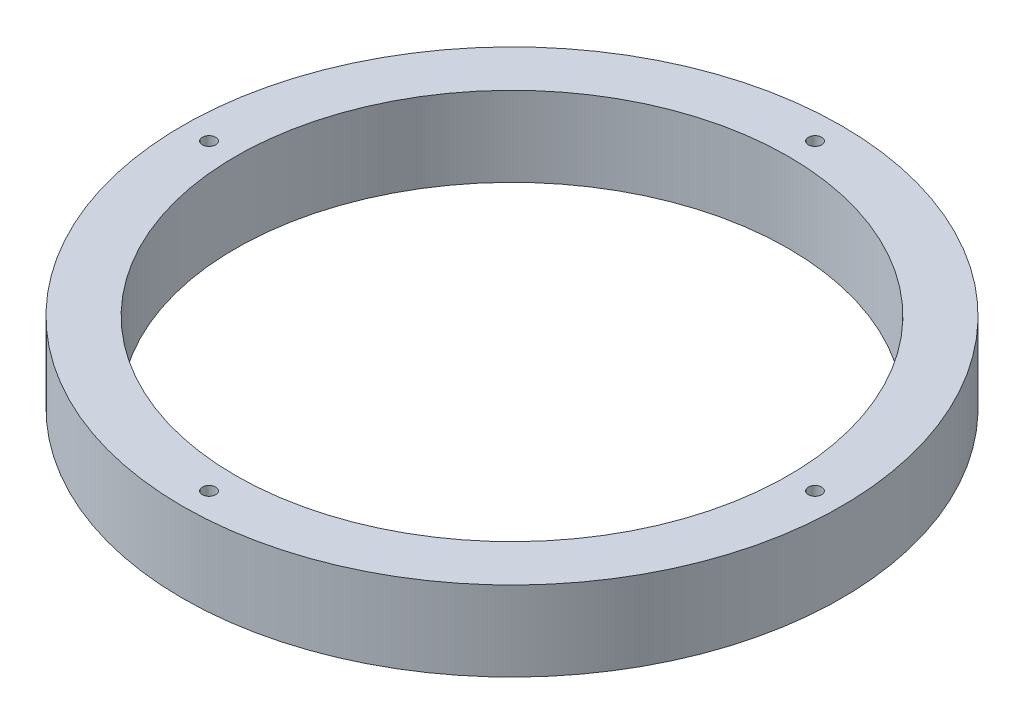
ISO-10303-21;
HEADER;
FILE_DESCRIPTION(('STEP AP214'),'2;1');
FILE_NAME('part.step','',(''),(''),'','','');
FILE_SCHEMA(('AUTOMOTIVE_DESIGN { 1 0 10303 214 1 1 1 1 }'));
ENDSEC;
DATA;
#1=APPLICATION_CONTEXT('core data for automotive mechanical design processes');
#2=APPLICATION_PROTOCOL_DEFINITION('international standard','automotive_design',2000,#1);
#3=PRODUCT_CONTEXT('',#1,'mechanical');
#4=PRODUCT('Part','Part','',(#3));
#5=PRODUCT_RELATED_PRODUCT_CATEGORY('part','',(#4));
#6=PRODUCT_DEFINITION_FORMATION('','',#4);
#7=PRODUCT_DEFINITION_CONTEXT('part definition',#1,'design');
#8=PRODUCT_DEFINITION('design','',#6,#7);
#9=PRODUCT_DEFINITION_SHAPE('','',#8);
#10=(LENGTH_UNIT() NAMED_UNIT(*) SI_UNIT(.MILLI.,.METRE.));
#11=(NAMED_UNIT(*) PLANE_ANGLE_UNIT() SI_UNIT($,.RADIAN.));
#12=(NAMED_UNIT(*) SI_UNIT($,.STERADIAN.) SOLID_ANGLE_UNIT());
#13=UNCERTAINTY_MEASURE_WITH_UNIT(LENGTH_MEASURE(1.E-05),#10,'distance_accuracy_value','');
#14=(GEOMETRIC_REPRESENTATION_CONTEXT(3) GLOBAL_UNCERTAINTY_ASSIGNED_CONTEXT((#13)) GLOBAL_UNIT_ASSIGNED_CONTEXT((#10,
#11,#12)) REPRESENTATION_CONTEXT('',''));
#15=CARTESIAN_POINT('',(0.,0.,0.));
#16=DIRECTION('',(0.,0.,1.));
#17=DIRECTION('',(1.,0.,0.));
#18=AXIS2_PLACEMENT_3D('',#15,#16,#17);
#19=CARTESIAN_POINT('',(0.,9.525,0.));
#20=DIRECTION('',(0.,1.,0.));
#21=DIRECTION('',(0.,0.,1.));
#22=AXIS2_PLACEMENT_3D('',#19,#20,#21);
#23=PLANE('',#22);
#24=CARTESIAN_POINT('',(2.04854260288338E-12,9.525,36.195));
#25=DIRECTION('',(0.,1.,0.));
#26=DIRECTION('',(0.,0.,1.));
#27=AXIS2_PLACEMENT_3D('',#24,#25,#26);
#28=CIRCLE('',#27,0.7937500000022);
#29=CARTESIAN_POINT('',(2.04854260288338E-12,9.525,36.9887500000022));
#30=VERTEX_POINT('',#29);
#31=EDGE_CURVE('E59',#30,#30,#28,.T.);
#32=ORIENTED_EDGE('',*,*,#31,.F.);
#33=EDGE_LOOP('',(#32));
#34=FACE_BOUND('',#33,.T.);
#35=CARTESIAN_POINT('',(0.,9.525,-36.195));
#36=DIRECTION('',(0.,1.,0.));
#37=DIRECTION('',(0.,0.,1.));
#38=AXIS2_PLACEMENT_3D('',#35,#36,#37);
#39=CIRCLE('',#38,0.79375);
#40=CARTESIAN_POINT('',(0.,9.525,-35.40125));
#41=VERTEX_POINT('',#40);
#42=EDGE_CURVE('E47',#41,#41,#39,.T.);
#43=ORIENTED_EDGE('',*,*,#42,.F.);
#44=EDGE_LOOP('',(#43));
#45=FACE_BOUND('',#44,.T.);
#46=CARTESIAN_POINT('',(0.,9.525,0.));
#47=DIRECTION('',(0.,1.,0.));
#48=DIRECTION('',(0.,0.,1.));
#49=AXIS2_PLACEMENT_3D('',#46,#47,#48);
#50=CIRCLE('',#49,39.37);
#51=CARTESIAN_POINT('',(0.,9.525,39.37));
#52=VERTEX_POINT('',#51);
#53=EDGE_CURVE('E10',#52,#52,#50,.T.);
#54=ORIENTED_EDGE('',*,*,#53,.T.);
#55=EDGE_LOOP('',(#54));
#56=FACE_BOUND('',#55,.T.);
#57=CARTESIAN_POINT('',(0.,9.525,0.));
#58=DIRECTION('',(0.,1.,0.));
#59=DIRECTION('',(0.,0.,1.));
#60=AXIS2_PLACEMENT_3D('',#57,#58,#59);
#61=CIRCLE('',#60,33.02);
#62=CARTESIAN_POINT('',(0.,9.525,33.02));
#63=VERTEX_POINT('',#62);
#64=EDGE_CURVE('E42',#63,#63,#61,.T.);
#65=ORIENTED_EDGE('',*,*,#64,.F.);
#66=EDGE_LOOP('',(#65));
#67=FACE_BOUND('',#66,.T.);
#68=CARTESIAN_POINT('',(36.195000000001,9.525,-1.02427130144169E-12));
#69=DIRECTION('',(0.,1.,0.));
#70=DIRECTION('',(0.,0.,1.));
#71=AXIS2_PLACEMENT_3D('',#68,#69,#70);
#72=CIRCLE('',#71,0.793750000000801);
#73=CARTESIAN_POINT('',(36.195000000001,9.525,0.793749999999776));
#74=VERTEX_POINT('',#73);
#75=EDGE_CURVE('E53',#74,#74,#72,.T.);
#76=ORIENTED_EDGE('',*,*,#75,.F.);
#77=EDGE_LOOP('',(#76));
#78=FACE_BOUND('',#77,.T.);
#79=CARTESIAN_POINT('',(-36.194999999999,9.525,1.02870391053121E-12));
#80=DIRECTION('',(0.,1.,0.));
#81=DIRECTION('',(0.,0.,1.));
#82=AXIS2_PLACEMENT_3D('',#79,#80,#81);
#83=CIRCLE('',#82,0.793750000001647);
#84=CARTESIAN_POINT('',(-36.194999999999,9.525,0.793750000002675));
#85=VERTEX_POINT('',#84);
#86=EDGE_CURVE('E65',#85,#85,#83,.T.);
#87=ORIENTED_EDGE('',*,*,#86,.F.);
#88=EDGE_LOOP('',(#87));
#89=FACE_BOUND('',#88,.T.);
#90=ADVANCED_FACE('F31',(#34,#45,#56,#67,#78,#89),#23,.T.);
#91=CARTESIAN_POINT('',(0.,0.,0.));
#92=DIRECTION('',(0.,1.,0.));
#93=DIRECTION('',(0.,0.,1.));
#94=AXIS2_PLACEMENT_3D('',#91,#92,#93);
#95=PLANE('',#94);
#96=CARTESIAN_POINT('',(2.04854260288338E-12,0.,36.195));
#97=DIRECTION('',(0.,1.,0.));
#98=DIRECTION('',(0.,0.,1.));
#99=AXIS2_PLACEMENT_3D('',#96,#97,#98);
#100=CIRCLE('',#99,0.7937500000022);
#101=CARTESIAN_POINT('',(2.04854260288338E-12,0.,36.9887500000022));
#102=VERTEX_POINT('',#101);
#103=EDGE_CURVE('E62',#102,#102,#100,.T.);
#104=ORIENTED_EDGE('',*,*,#103,.T.);
#105=EDGE_LOOP('',(#104));
#106=FACE_BOUND('',#105,.T.);
#107=CARTESIAN_POINT('',(0.,0.,-36.195));
#108=DIRECTION('',(0.,1.,0.));
#109=DIRECTION('',(0.,0.,1.));
#110=AXIS2_PLACEMENT_3D('',#107,#108,#109);
#111=CIRCLE('',#110,0.79375);
#112=CARTESIAN_POINT('',(0.,0.,-35.40125));
#113=VERTEX_POINT('',#112);
#114=EDGE_CURVE('E50',#113,#113,#111,.T.);
#115=ORIENTED_EDGE('',*,*,#114,.T.);
#116=EDGE_LOOP('',(#115));
#117=FACE_BOUND('',#116,.T.);
#118=CARTESIAN_POINT('',(0.,0.,0.));
#119=DIRECTION('',(0.,1.,0.));
#120=DIRECTION('',(0.,0.,1.));
#121=AXIS2_PLACEMENT_3D('',#118,#119,#120);
#122=CIRCLE('',#121,39.37);
#123=CARTESIAN_POINT('',(0.,0.,39.37));
#124=VERTEX_POINT('',#123);
#125=EDGE_CURVE('E35',#124,#124,#122,.T.);
#126=ORIENTED_EDGE('',*,*,#125,.F.);
#127=EDGE_LOOP('',(#126));
#128=FACE_BOUND('',#127,.T.);
#129=CARTESIAN_POINT('',(0.,0.,0.));
#130=DIRECTION('',(0.,1.,0.));
#131=DIRECTION('',(0.,0.,1.));
#132=AXIS2_PLACEMENT_3D('',#129,#130,#131);
#133=CIRCLE('',#132,33.02);
#134=CARTESIAN_POINT('',(0.,0.,33.02));
#135=VERTEX_POINT('',#134);
#136=EDGE_CURVE('E44',#135,#135,#133,.T.);
#137=ORIENTED_EDGE('',*,*,#136,.T.);
#138=EDGE_LOOP('',(#137));
#139=FACE_BOUND('',#138,.T.);
#140=CARTESIAN_POINT('',(36.195000000001,0.,-1.02427130144169E-12));
#141=DIRECTION('',(0.,1.,0.));
#142=DIRECTION('',(0.,0.,1.));
#143=AXIS2_PLACEMENT_3D('',#140,#141,#142);
#144=CIRCLE('',#143,0.793750000000801);
#145=CARTESIAN_POINT('',(36.195000000001,0.,0.793749999999776));
#146=VERTEX_POINT('',#145);
#147=EDGE_CURVE('E56',#146,#146,#144,.T.);
#148=ORIENTED_EDGE('',*,*,#147,.T.);
#149=EDGE_LOOP('',(#148));
#150=FACE_BOUND('',#149,.T.);
#151=CARTESIAN_POINT('',(-36.194999999999,0.,1.02870391053121E-12));
#152=DIRECTION('',(0.,1.,0.));
#153=DIRECTION('',(0.,0.,1.));
#154=AXIS2_PLACEMENT_3D('',#151,#152,#153);
#155=CIRCLE('',#154,0.793750000001647);
#156=CARTESIAN_POINT('',(-36.194999999999,0.,0.793750000002675));
#157=VERTEX_POINT('',#156);
#158=EDGE_CURVE('E68',#157,#157,#155,.T.);
#159=ORIENTED_EDGE('',*,*,#158,.T.);
#160=EDGE_LOOP('',(#159));
#161=FACE_BOUND('',#160,.T.);
#162=ADVANCED_FACE('F78',(#106,#117,#128,#139,#150,#161),#95,.F.);
#163=CARTESIAN_POINT('',(0.,9.525,0.));
#164=DIRECTION('',(0.,-1.,0.));
#165=DIRECTION('',(0.,0.,-1.));
#166=AXIS2_PLACEMENT_3D('',#163,#164,#165);
#167=CYLINDRICAL_SURFACE('',#166,39.37);
#168=ORIENTED_EDGE('',*,*,#53,.F.);
#169=EDGE_LOOP('',(#168));
#170=FACE_BOUND('',#169,.T.);
#171=ORIENTED_EDGE('',*,*,#125,.T.);
#172=EDGE_LOOP('',(#171));
#173=FACE_BOUND('',#172,.T.);
#174=ADVANCED_FACE('F33',(#170,#173),#167,.T.);
#175=CARTESIAN_POINT('',(0.,9.525,0.));
#176=DIRECTION('',(0.,-1.,0.));
#177=DIRECTION('',(0.,0.,-1.));
#178=AXIS2_PLACEMENT_3D('',#175,#176,#177);
#179=CYLINDRICAL_SURFACE('',#178,33.02);
#180=ORIENTED_EDGE('',*,*,#64,.T.);
#181=EDGE_LOOP('',(#180));
#182=FACE_BOUND('',#181,.T.);
#183=ORIENTED_EDGE('',*,*,#136,.F.);
#184=EDGE_LOOP('',(#183));
#185=FACE_BOUND('',#184,.T.);
#186=ADVANCED_FACE('F88',(#182,#185),#179,.F.);
#187=CARTESIAN_POINT('',(0.,9.525,-36.195));
#188=DIRECTION('',(0.,-1.,0.));
#189=DIRECTION('',(0.,0.,-1.));
#190=AXIS2_PLACEMENT_3D('',#187,#188,#189);
#191=CYLINDRICAL_SURFACE('',#190,0.79375);
#192=ORIENTED_EDGE('',*,*,#42,.T.);
#193=EDGE_LOOP('',(#192));
#194=FACE_BOUND('',#193,.T.);
#195=ORIENTED_EDGE('',*,*,#114,.F.);
#196=EDGE_LOOP('',(#195));
#197=FACE_BOUND('',#196,.T.);
#198=ADVANCED_FACE('F91',(#194,#197),#191,.F.);
#199=CARTESIAN_POINT('',(36.195000000001,9.525,-1.02427130144169E-12));
#200=DIRECTION('',(0.,-1.,0.));
#201=DIRECTION('',(0.,0.,-1.));
#202=AXIS2_PLACEMENT_3D('',#199,#200,#201);
#203=CYLINDRICAL_SURFACE('',#202,0.793750000000801);
#204=ORIENTED_EDGE('',*,*,#75,.T.);
#205=EDGE_LOOP('',(#204));
#206=FACE_BOUND('',#205,.T.);
#207=ORIENTED_EDGE('',*,*,#147,.F.);
#208=EDGE_LOOP('',(#207));
#209=FACE_BOUND('',#208,.T.);
#210=ADVANCED_FACE('F95',(#206,#209),#203,.F.);
#211=CARTESIAN_POINT('',(2.04854260288338E-12,9.525,36.195));
#212=DIRECTION('',(0.,-1.,0.));
#213=DIRECTION('',(0.,0.,-1.));
#214=AXIS2_PLACEMENT_3D('',#211,#212,#213);
#215=CYLINDRICAL_SURFACE('',#214,0.7937500000022);
#216=ORIENTED_EDGE('',*,*,#31,.T.);
#217=EDGE_LOOP('',(#216));
#218=FACE_BOUND('',#217,.T.);
#219=ORIENTED_EDGE('',*,*,#103,.F.);
#220=EDGE_LOOP('',(#219));
#221=FACE_BOUND('',#220,.T.);
#222=ADVANCED_FACE('F99',(#218,#221),#215,.F.);
#223=CARTESIAN_POINT('',(-36.194999999999,9.525,1.02870391053121E-12));
#224=DIRECTION('',(0.,-1.,0.));
#225=DIRECTION('',(0.,0.,-1.));
#226=AXIS2_PLACEMENT_3D('',#223,#224,#225);
#227=CYLINDRICAL_SURFACE('',#226,0.793750000001647);
#228=ORIENTED_EDGE('',*,*,#86,.T.);
#229=EDGE_LOOP('',(#228));
#230=FACE_BOUND('',#229,.T.);
#231=ORIENTED_EDGE('',*,*,#158,.F.);
#232=EDGE_LOOP('',(#231));
#233=FACE_BOUND('',#232,.T.);
#234=ADVANCED_FACE('F74',(#230,#233),#227,.F.);
#235=CLOSED_SHELL('',(#90,#162,#174,#186,#198,#210,#222,#234));
#236=MANIFOLD_SOLID_BREP('B2',#235);
#237=ADVANCED_BREP_SHAPE_REPRESENTATION('',(#18,#236),#14);
#238=SHAPE_DEFINITION_REPRESENTATION(#9,#237);
ENDSEC;
END-ISO-10303-21;
